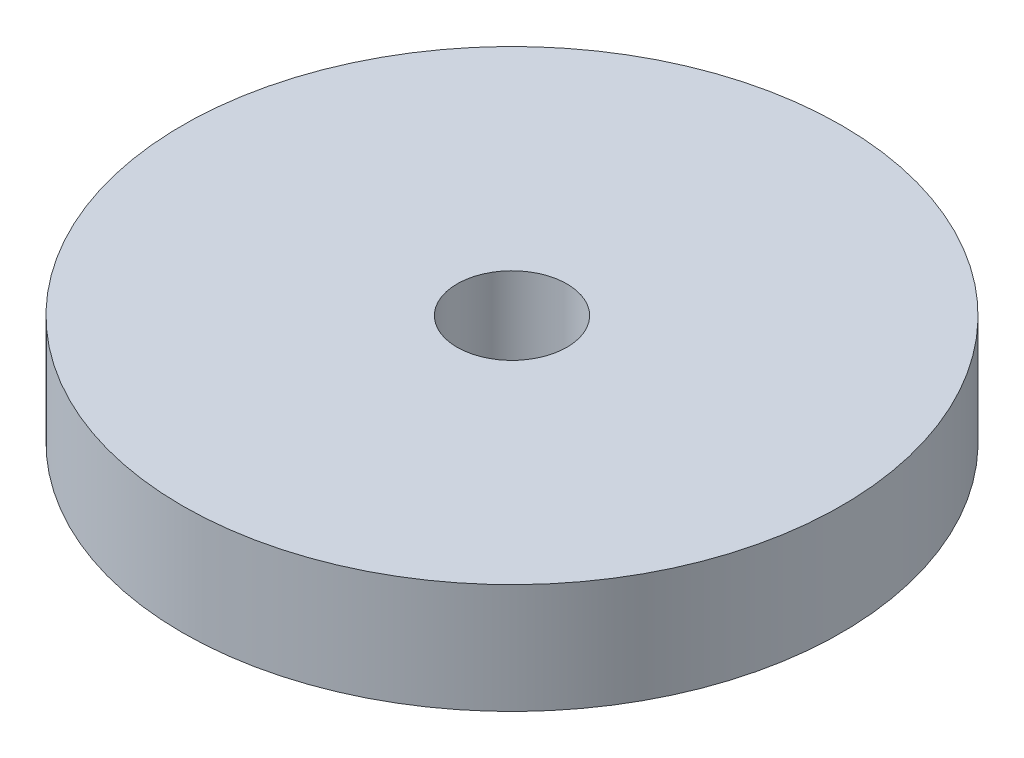
ISO-10303-21;
HEADER;
FILE_DESCRIPTION(('STEP AP214'),'2;1');
FILE_NAME('part.step','',(''),(''),'','','');
FILE_SCHEMA(('AUTOMOTIVE_DESIGN { 1 0 10303 214 1 1 1 1 }'));
ENDSEC;
DATA;
#1=APPLICATION_CONTEXT('core data for automotive mechanical design processes');
#2=APPLICATION_PROTOCOL_DEFINITION('international standard','automotive_design',2000,#1);
#3=PRODUCT_CONTEXT('',#1,'mechanical');
#4=PRODUCT('Part','Part','',(#3));
#5=PRODUCT_RELATED_PRODUCT_CATEGORY('part','',(#4));
#6=PRODUCT_DEFINITION_FORMATION('','',#4);
#7=PRODUCT_DEFINITION_CONTEXT('part definition',#1,'design');
#8=PRODUCT_DEFINITION('design','',#6,#7);
#9=PRODUCT_DEFINITION_SHAPE('','',#8);
#10=(LENGTH_UNIT() NAMED_UNIT(*) SI_UNIT(.MILLI.,.METRE.));
#11=(NAMED_UNIT(*) PLANE_ANGLE_UNIT() SI_UNIT($,.RADIAN.));
#12=(NAMED_UNIT(*) SI_UNIT($,.STERADIAN.) SOLID_ANGLE_UNIT());
#13=UNCERTAINTY_MEASURE_WITH_UNIT(LENGTH_MEASURE(1.E-05),#10,'distance_accuracy_value','');
#14=(GEOMETRIC_REPRESENTATION_CONTEXT(3) GLOBAL_UNCERTAINTY_ASSIGNED_CONTEXT((#13)) GLOBAL_UNIT_ASSIGNED_CONTEXT((#10,
#11,#12)) REPRESENTATION_CONTEXT('',''));
#15=CARTESIAN_POINT('',(0.,0.,0.));
#16=DIRECTION('',(0.,0.,1.));
#17=DIRECTION('',(1.,0.,0.));
#18=AXIS2_PLACEMENT_3D('',#15,#16,#17);
#19=CARTESIAN_POINT('',(0.,3.175,0.));
#20=DIRECTION('',(0.,1.,0.));
#21=DIRECTION('',(0.,0.,1.));
#22=AXIS2_PLACEMENT_3D('',#19,#20,#21);
#23=PLANE('',#22);
#24=CARTESIAN_POINT('',(0.,3.175,0.));
#25=DIRECTION('',(0.,1.,0.));
#26=DIRECTION('',(0.,0.,1.));
#27=AXIS2_PLACEMENT_3D('',#24,#25,#26);
#28=CIRCLE('',#27,9.525);
#29=CARTESIAN_POINT('',(0.,3.175,9.525));
#30=VERTEX_POINT('',#29);
#31=EDGE_CURVE('E10',#30,#30,#28,.T.);
#32=ORIENTED_EDGE('',*,*,#31,.T.);
#33=EDGE_LOOP('',(#32));
#34=FACE_BOUND('',#33,.T.);
#35=CARTESIAN_POINT('',(0.,3.175,0.));
#36=DIRECTION('',(0.,1.,0.));
#37=DIRECTION('',(0.,0.,1.));
#38=AXIS2_PLACEMENT_3D('',#35,#36,#37);
#39=CIRCLE('',#38,1.5875);
#40=CARTESIAN_POINT('',(0.,3.175,1.5875));
#41=VERTEX_POINT('',#40);
#42=EDGE_CURVE('E45',#41,#41,#39,.T.);
#43=ORIENTED_EDGE('',*,*,#42,.F.);
#44=EDGE_LOOP('',(#43));
#45=FACE_BOUND('',#44,.T.);
#46=ADVANCED_FACE('F34',(#34,#45),#23,.T.);
#47=CARTESIAN_POINT('',(0.,0.,0.));
#48=DIRECTION('',(0.,1.,0.));
#49=DIRECTION('',(0.,0.,1.));
#50=AXIS2_PLACEMENT_3D('',#47,#48,#49);
#51=PLANE('',#50);
#52=CARTESIAN_POINT('',(0.,0.,0.));
#53=DIRECTION('',(0.,1.,0.));
#54=DIRECTION('',(0.,0.,1.));
#55=AXIS2_PLACEMENT_3D('',#52,#53,#54);
#56=CIRCLE('',#55,9.525);
#57=CARTESIAN_POINT('',(0.,0.,9.525));
#58=VERTEX_POINT('',#57);
#59=EDGE_CURVE('E38',#58,#58,#56,.T.);
#60=ORIENTED_EDGE('',*,*,#59,.F.);
#61=EDGE_LOOP('',(#60));
#62=FACE_BOUND('',#61,.T.);
#63=CARTESIAN_POINT('',(0.,0.,0.));
#64=DIRECTION('',(0.,1.,0.));
#65=DIRECTION('',(0.,0.,1.));
#66=AXIS2_PLACEMENT_3D('',#63,#64,#65);
#67=CIRCLE('',#66,1.5875);
#68=CARTESIAN_POINT('',(0.,0.,1.5875));
#69=VERTEX_POINT('',#68);
#70=EDGE_CURVE('E47',#69,#69,#67,.T.);
#71=ORIENTED_EDGE('',*,*,#70,.T.);
#72=EDGE_LOOP('',(#71));
#73=FACE_BOUND('',#72,.T.);
#74=ADVANCED_FACE('F57',(#62,#73),#51,.F.);
#75=CARTESIAN_POINT('',(0.,3.175,0.));
#76=DIRECTION('',(0.,-1.,0.));
#77=DIRECTION('',(0.,0.,-1.));
#78=AXIS2_PLACEMENT_3D('',#75,#76,#77);
#79=CYLINDRICAL_SURFACE('',#78,9.525);
#80=ORIENTED_EDGE('',*,*,#31,.F.);
#81=EDGE_LOOP('',(#80));
#82=FACE_BOUND('',#81,.T.);
#83=ORIENTED_EDGE('',*,*,#59,.T.);
#84=EDGE_LOOP('',(#83));
#85=FACE_BOUND('',#84,.T.);
#86=ADVANCED_FACE('F36',(#82,#85),#79,.T.);
#87=CARTESIAN_POINT('',(0.,3.175,0.));
#88=DIRECTION('',(0.,-1.,0.));
#89=DIRECTION('',(0.,0.,-1.));
#90=AXIS2_PLACEMENT_3D('',#87,#88,#89);
#91=CYLINDRICAL_SURFACE('',#90,1.5875);
#92=ORIENTED_EDGE('',*,*,#42,.T.);
#93=EDGE_LOOP('',(#92));
#94=FACE_BOUND('',#93,.T.);
#95=ORIENTED_EDGE('',*,*,#70,.F.);
#96=EDGE_LOOP('',(#95));
#97=FACE_BOUND('',#96,.T.);
#98=ADVANCED_FACE('F53',(#94,#97),#91,.F.);
#99=CLOSED_SHELL('',(#46,#74,#86,#98));
#100=MANIFOLD_SOLID_BREP('B2',#99);
#101=ADVANCED_BREP_SHAPE_REPRESENTATION('',(#18,#100),#14);
#102=SHAPE_DEFINITION_REPRESENTATION(#9,#101);
ENDSEC;
END-ISO-10303-21;
